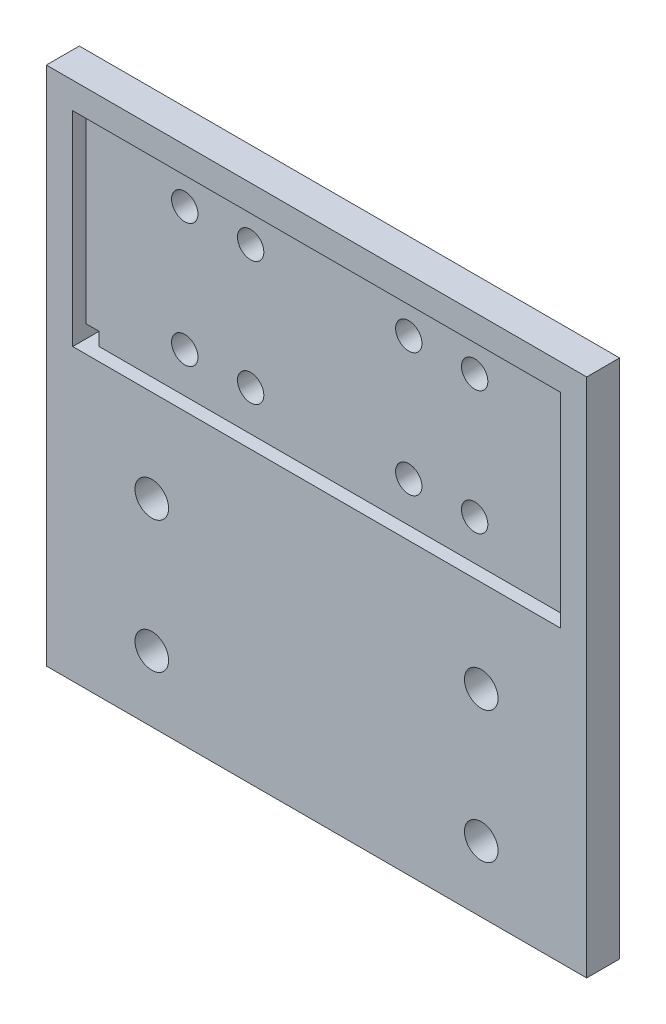
ISO-10303-21;
HEADER;
FILE_DESCRIPTION(('STEP AP214'),'2;1');
FILE_NAME('part.step','',(''),(''),'','','');
FILE_SCHEMA(('AUTOMOTIVE_DESIGN { 1 0 10303 214 1 1 1 1 }'));
ENDSEC;
DATA;
#1=APPLICATION_CONTEXT('core data for automotive mechanical design processes');
#2=APPLICATION_PROTOCOL_DEFINITION('international standard','automotive_design',2000,#1);
#3=PRODUCT_CONTEXT('',#1,'mechanical');
#4=PRODUCT('Part','Part','',(#3));
#5=PRODUCT_RELATED_PRODUCT_CATEGORY('part','',(#4));
#6=PRODUCT_DEFINITION_FORMATION('','',#4);
#7=PRODUCT_DEFINITION_CONTEXT('part definition',#1,'design');
#8=PRODUCT_DEFINITION('design','',#6,#7);
#9=PRODUCT_DEFINITION_SHAPE('','',#8);
#10=(LENGTH_UNIT() NAMED_UNIT(*) SI_UNIT(.MILLI.,.METRE.));
#11=(NAMED_UNIT(*) PLANE_ANGLE_UNIT() SI_UNIT($,.RADIAN.));
#12=(NAMED_UNIT(*) SI_UNIT($,.STERADIAN.) SOLID_ANGLE_UNIT());
#13=UNCERTAINTY_MEASURE_WITH_UNIT(LENGTH_MEASURE(1.E-05),#10,'distance_accuracy_value','');
#14=(GEOMETRIC_REPRESENTATION_CONTEXT(3) GLOBAL_UNCERTAINTY_ASSIGNED_CONTEXT((#13)) GLOBAL_UNIT_ASSIGNED_CONTEXT((#10,
#11,#12)) REPRESENTATION_CONTEXT('',''));
#15=CARTESIAN_POINT('',(0.,0.,0.));
#16=DIRECTION('',(0.,0.,1.));
#17=DIRECTION('',(1.,0.,0.));
#18=AXIS2_PLACEMENT_3D('',#15,#16,#17);
#19=CARTESIAN_POINT('',(0.,0.,5.));
#20=DIRECTION('',(0.,0.,-1.));
#21=DIRECTION('',(-1.,0.,0.));
#22=AXIS2_PLACEMENT_3D('',#19,#20,#21);
#23=PLANE('',#22);
#24=DIRECTION('',(1.,0.,0.));
#25=VECTOR('',#24,1.);
#26=CARTESIAN_POINT('',(-37.,-15.5,5.));
#27=LINE('',#26,#25);
#28=CARTESIAN_POINT('',(-37.,-15.5,5.));
#29=VERTEX_POINT('',#28);
#30=CARTESIAN_POINT('',(37.,-15.5,5.));
#31=VERTEX_POINT('',#30);
#32=EDGE_CURVE('E221',#29,#31,#27,.T.);
#33=ORIENTED_EDGE('',*,*,#32,.F.);
#34=DIRECTION('',(0.,-1.,0.));
#35=VECTOR('',#34,1.);
#36=CARTESIAN_POINT('',(-37.,15.5,5.));
#37=LINE('',#36,#35);
#38=CARTESIAN_POINT('',(-37.,15.5,5.));
#39=VERTEX_POINT('',#38);
#40=EDGE_CURVE('E218',#39,#29,#37,.T.);
#41=ORIENTED_EDGE('',*,*,#40,.F.);
#42=DIRECTION('',(-1.,0.,0.));
#43=VECTOR('',#42,1.);
#44=CARTESIAN_POINT('',(37.,15.5,5.));
#45=LINE('',#44,#43);
#46=CARTESIAN_POINT('',(37.,15.5,5.));
#47=VERTEX_POINT('',#46);
#48=EDGE_CURVE('E229',#47,#39,#45,.T.);
#49=ORIENTED_EDGE('',*,*,#48,.F.);
#50=DIRECTION('',(0.,1.,0.));
#51=VECTOR('',#50,1.);
#52=CARTESIAN_POINT('',(37.,-15.5,5.));
#53=LINE('',#52,#51);
#54=EDGE_CURVE('E226',#31,#47,#53,.T.);
#55=ORIENTED_EDGE('',*,*,#54,.F.);
#56=EDGE_LOOP('',(#33,#41,#49,#55));
#57=FACE_BOUND('',#56,.T.);
#58=DIRECTION('',(0.,1.,0.));
#59=VECTOR('',#58,1.);
#60=CARTESIAN_POINT('',(41.,-19.5,5.));
#61=LINE('',#60,#59);
#62=CARTESIAN_POINT('',(41.,-59.5,5.));
#63=VERTEX_POINT('',#62);
#64=CARTESIAN_POINT('',(41.,19.5,5.));
#65=VERTEX_POINT('',#64);
#66=EDGE_CURVE('E278',#63,#65,#61,.T.);
#67=ORIENTED_EDGE('',*,*,#66,.T.);
#68=DIRECTION('',(-1.,0.,0.));
#69=VECTOR('',#68,1.);
#70=CARTESIAN_POINT('',(-41.,19.5,5.));
#71=LINE('',#70,#69);
#72=CARTESIAN_POINT('',(-41.,19.5,5.));
#73=VERTEX_POINT('',#72);
#74=EDGE_CURVE('E282',#65,#73,#71,.T.);
#75=ORIENTED_EDGE('',*,*,#74,.T.);
#76=DIRECTION('',(0.,-1.,0.));
#77=VECTOR('',#76,1.);
#78=CARTESIAN_POINT('',(-41.,-19.5,5.));
#79=LINE('',#78,#77);
#80=CARTESIAN_POINT('',(-41.,-59.5,5.));
#81=VERTEX_POINT('',#80);
#82=EDGE_CURVE('E286',#73,#81,#79,.T.);
#83=ORIENTED_EDGE('',*,*,#82,.T.);
#84=DIRECTION('',(1.,0.,0.));
#85=VECTOR('',#84,1.);
#86=CARTESIAN_POINT('',(-41.,-59.5,5.));
#87=LINE('',#86,#85);
#88=EDGE_CURVE('E289',#81,#63,#87,.T.);
#89=ORIENTED_EDGE('',*,*,#88,.T.);
#90=EDGE_LOOP('',(#67,#75,#83,#89));
#91=FACE_BOUND('',#90,.T.);
#92=CARTESIAN_POINT('',(-25.,-29.5,5.));
#93=DIRECTION('',(0.,0.,1.));
#94=DIRECTION('',(1.,0.,0.));
#95=AXIS2_PLACEMENT_3D('',#92,#93,#94);
#96=CIRCLE('',#95,2.55);
#97=CARTESIAN_POINT('',(-22.45,-29.5,5.));
#98=VERTEX_POINT('',#97);
#99=EDGE_CURVE('E270',#98,#98,#96,.T.);
#100=ORIENTED_EDGE('',*,*,#99,.F.);
#101=EDGE_LOOP('',(#100));
#102=FACE_BOUND('',#101,.T.);
#103=CARTESIAN_POINT('',(-25.,-49.5,5.));
#104=DIRECTION('',(0.,0.,1.));
#105=DIRECTION('',(1.,0.,0.));
#106=AXIS2_PLACEMENT_3D('',#103,#104,#105);
#107=CIRCLE('',#106,2.55);
#108=CARTESIAN_POINT('',(-22.45,-49.5,5.));
#109=VERTEX_POINT('',#108);
#110=EDGE_CURVE('E262',#109,#109,#107,.T.);
#111=ORIENTED_EDGE('',*,*,#110,.F.);
#112=EDGE_LOOP('',(#111));
#113=FACE_BOUND('',#112,.T.);
#114=CARTESIAN_POINT('',(25.,-49.5,5.));
#115=DIRECTION('',(0.,0.,1.));
#116=DIRECTION('',(-1.,0.,0.));
#117=AXIS2_PLACEMENT_3D('',#114,#115,#116);
#118=CIRCLE('',#117,2.55);
#119=CARTESIAN_POINT('',(22.45,-49.5,5.));
#120=VERTEX_POINT('',#119);
#121=EDGE_CURVE('E254',#120,#120,#118,.T.);
#122=ORIENTED_EDGE('',*,*,#121,.F.);
#123=EDGE_LOOP('',(#122));
#124=FACE_BOUND('',#123,.T.);
#125=CARTESIAN_POINT('',(25.,-29.5,5.));
#126=DIRECTION('',(0.,0.,1.));
#127=DIRECTION('',(-1.,0.,0.));
#128=AXIS2_PLACEMENT_3D('',#125,#126,#127);
#129=CIRCLE('',#128,2.55);
#130=CARTESIAN_POINT('',(22.45,-29.5,5.));
#131=VERTEX_POINT('',#130);
#132=EDGE_CURVE('E246',#131,#131,#129,.T.);
#133=ORIENTED_EDGE('',*,*,#132,.F.);
#134=EDGE_LOOP('',(#133));
#135=FACE_BOUND('',#134,.T.);
#136=ADVANCED_FACE('F39',(#57,#91,#102,#113,#124,#135),#23,.F.);
#137=CARTESIAN_POINT('',(0.,0.,0.));
#138=DIRECTION('',(0.,0.,-1.));
#139=DIRECTION('',(-1.,0.,0.));
#140=AXIS2_PLACEMENT_3D('',#137,#138,#139);
#141=PLANE('',#140);
#142=DIRECTION('',(0.,1.,0.));
#143=VECTOR('',#142,1.);
#144=CARTESIAN_POINT('',(-37.,0.,0.));
#145=LINE('',#144,#143);
#146=CARTESIAN_POINT('',(-37.,13.5,0.));
#147=VERTEX_POINT('',#146);
#148=CARTESIAN_POINT('',(-37.,15.5,0.));
#149=VERTEX_POINT('',#148);
#150=EDGE_CURVE('E11',#147,#149,#145,.T.);
#151=ORIENTED_EDGE('',*,*,#150,.F.);
#152=DIRECTION('',(-1.,0.,0.));
#153=VECTOR('',#152,1.);
#154=CARTESIAN_POINT('',(0.,13.5,0.));
#155=LINE('',#154,#153);
#156=CARTESIAN_POINT('',(-35.,13.5,0.));
#157=VERTEX_POINT('',#156);
#158=EDGE_CURVE('E359',#157,#147,#155,.T.);
#159=ORIENTED_EDGE('',*,*,#158,.F.);
#160=DIRECTION('',(0.,-1.,0.));
#161=VECTOR('',#160,1.);
#162=CARTESIAN_POINT('',(-35.,0.,0.));
#163=LINE('',#162,#161);
#164=CARTESIAN_POINT('',(-35.,15.5,0.));
#165=VERTEX_POINT('',#164);
#166=EDGE_CURVE('E362',#165,#157,#163,.T.);
#167=ORIENTED_EDGE('',*,*,#166,.F.);
#168=DIRECTION('',(1.,0.,0.));
#169=VECTOR('',#168,1.);
#170=CARTESIAN_POINT('',(0.,15.5,0.));
#171=LINE('',#170,#169);
#172=EDGE_CURVE('E48',#149,#165,#171,.T.);
#173=ORIENTED_EDGE('',*,*,#172,.F.);
#174=EDGE_LOOP('',(#151,#159,#167,#173));
#175=FACE_BOUND('',#174,.T.);
#176=CARTESIAN_POINT('',(-22.,-9.39999999999999,0.));
#177=DIRECTION('',(0.,0.,-1.));
#178=DIRECTION('',(-1.,0.,0.));
#179=AXIS2_PLACEMENT_3D('',#176,#177,#178);
#180=CIRCLE('',#179,2.);
#181=CARTESIAN_POINT('',(-24.,-9.39999999999999,0.));
#182=VERTEX_POINT('',#181);
#183=EDGE_CURVE('E222',#182,#182,#180,.T.);
#184=ORIENTED_EDGE('',*,*,#183,.F.);
#185=EDGE_LOOP('',(#184));
#186=FACE_BOUND('',#185,.T.);
#187=CARTESIAN_POINT('',(-12.,-9.39999999999999,0.));
#188=DIRECTION('',(0.,0.,-1.));
#189=DIRECTION('',(-1.,0.,0.));
#190=AXIS2_PLACEMENT_3D('',#187,#188,#189);
#191=CIRCLE('',#190,2.);
#192=CARTESIAN_POINT('',(-14.,-9.39999999999999,0.));
#193=VERTEX_POINT('',#192);
#194=EDGE_CURVE('E445',#193,#193,#191,.T.);
#195=ORIENTED_EDGE('',*,*,#194,.F.);
#196=EDGE_LOOP('',(#195));
#197=FACE_BOUND('',#196,.T.);
#198=CARTESIAN_POINT('',(12.,-9.4,0.));
#199=DIRECTION('',(0.,0.,-1.));
#200=DIRECTION('',(-1.,0.,0.));
#201=AXIS2_PLACEMENT_3D('',#198,#199,#200);
#202=CIRCLE('',#201,2.);
#203=CARTESIAN_POINT('',(10.,-9.4,0.));
#204=VERTEX_POINT('',#203);
#205=EDGE_CURVE('E441',#204,#204,#202,.T.);
#206=ORIENTED_EDGE('',*,*,#205,.F.);
#207=EDGE_LOOP('',(#206));
#208=FACE_BOUND('',#207,.T.);
#209=CARTESIAN_POINT('',(22.,-9.4,0.));
#210=DIRECTION('',(0.,0.,-1.));
#211=DIRECTION('',(-1.,0.,0.));
#212=AXIS2_PLACEMENT_3D('',#209,#210,#211);
#213=CIRCLE('',#212,2.);
#214=CARTESIAN_POINT('',(20.,-9.4,0.));
#215=VERTEX_POINT('',#214);
#216=EDGE_CURVE('E437',#215,#215,#213,.T.);
#217=ORIENTED_EDGE('',*,*,#216,.F.);
#218=EDGE_LOOP('',(#217));
#219=FACE_BOUND('',#218,.T.);
#220=CARTESIAN_POINT('',(22.,9.40000000000001,0.));
#221=DIRECTION('',(0.,0.,-1.));
#222=DIRECTION('',(-1.,0.,0.));
#223=AXIS2_PLACEMENT_3D('',#220,#221,#222);
#224=CIRCLE('',#223,2.);
#225=CARTESIAN_POINT('',(20.,9.40000000000001,0.));
#226=VERTEX_POINT('',#225);
#227=EDGE_CURVE('E433',#226,#226,#224,.T.);
#228=ORIENTED_EDGE('',*,*,#227,.F.);
#229=EDGE_LOOP('',(#228));
#230=FACE_BOUND('',#229,.T.);
#231=CARTESIAN_POINT('',(12.,9.40000000000001,0.));
#232=DIRECTION('',(0.,0.,-1.));
#233=DIRECTION('',(-1.,0.,0.));
#234=AXIS2_PLACEMENT_3D('',#231,#232,#233);
#235=CIRCLE('',#234,2.);
#236=CARTESIAN_POINT('',(10.,9.40000000000001,0.));
#237=VERTEX_POINT('',#236);
#238=EDGE_CURVE('E429',#237,#237,#235,.T.);
#239=ORIENTED_EDGE('',*,*,#238,.F.);
#240=EDGE_LOOP('',(#239));
#241=FACE_BOUND('',#240,.T.);
#242=CARTESIAN_POINT('',(-12.,9.40000000000001,0.));
#243=DIRECTION('',(0.,0.,-1.));
#244=DIRECTION('',(-1.,0.,0.));
#245=AXIS2_PLACEMENT_3D('',#242,#243,#244);
#246=CIRCLE('',#245,2.);
#247=CARTESIAN_POINT('',(-14.,9.40000000000001,0.));
#248=VERTEX_POINT('',#247);
#249=EDGE_CURVE('E425',#248,#248,#246,.T.);
#250=ORIENTED_EDGE('',*,*,#249,.F.);
#251=EDGE_LOOP('',(#250));
#252=FACE_BOUND('',#251,.T.);
#253=DIRECTION('',(0.,-1.,0.));
#254=VECTOR('',#253,1.);
#255=CARTESIAN_POINT('',(37.,0.,0.));
#256=LINE('',#255,#254);
#257=CARTESIAN_POINT('',(37.,-13.5,0.));
#258=VERTEX_POINT('',#257);
#259=CARTESIAN_POINT('',(37.,-15.5,0.));
#260=VERTEX_POINT('',#259);
#261=EDGE_CURVE('E356',#258,#260,#256,.T.);
#262=ORIENTED_EDGE('',*,*,#261,.F.);
#263=DIRECTION('',(1.,0.,0.));
#264=VECTOR('',#263,1.);
#265=CARTESIAN_POINT('',(0.,-13.5,0.));
#266=LINE('',#265,#264);
#267=CARTESIAN_POINT('',(35.,-13.5,0.));
#268=VERTEX_POINT('',#267);
#269=EDGE_CURVE('E180',#268,#258,#266,.T.);
#270=ORIENTED_EDGE('',*,*,#269,.F.);
#271=DIRECTION('',(0.,1.,0.));
#272=VECTOR('',#271,1.);
#273=CARTESIAN_POINT('',(35.,0.,0.));
#274=LINE('',#273,#272);
#275=CARTESIAN_POINT('',(35.,-15.5,0.));
#276=VERTEX_POINT('',#275);
#277=EDGE_CURVE('E350',#276,#268,#274,.T.);
#278=ORIENTED_EDGE('',*,*,#277,.F.);
#279=DIRECTION('',(-1.,0.,0.));
#280=VECTOR('',#279,1.);
#281=CARTESIAN_POINT('',(0.,-15.5,0.));
#282=LINE('',#281,#280);
#283=EDGE_CURVE('E353',#260,#276,#282,.T.);
#284=ORIENTED_EDGE('',*,*,#283,.F.);
#285=EDGE_LOOP('',(#262,#270,#278,#284));
#286=FACE_BOUND('',#285,.T.);
#287=DIRECTION('',(0.,-1.,0.));
#288=VECTOR('',#287,1.);
#289=CARTESIAN_POINT('',(37.,0.,0.));
#290=LINE('',#289,#288);
#291=CARTESIAN_POINT('',(37.,15.5,0.));
#292=VERTEX_POINT('',#291);
#293=CARTESIAN_POINT('',(37.,13.5,0.));
#294=VERTEX_POINT('',#293);
#295=EDGE_CURVE('E345',#292,#294,#290,.T.);
#296=ORIENTED_EDGE('',*,*,#295,.F.);
#297=DIRECTION('',(1.,0.,0.));
#298=VECTOR('',#297,1.);
#299=CARTESIAN_POINT('',(0.,15.5,0.));
#300=LINE('',#299,#298);
#301=CARTESIAN_POINT('',(35.,15.5,0.));
#302=VERTEX_POINT('',#301);
#303=EDGE_CURVE('E334',#302,#292,#300,.T.);
#304=ORIENTED_EDGE('',*,*,#303,.F.);
#305=DIRECTION('',(0.,1.,0.));
#306=VECTOR('',#305,1.);
#307=CARTESIAN_POINT('',(35.,0.,0.));
#308=LINE('',#307,#306);
#309=CARTESIAN_POINT('',(35.,13.5,0.));
#310=VERTEX_POINT('',#309);
#311=EDGE_CURVE('E338',#310,#302,#308,.T.);
#312=ORIENTED_EDGE('',*,*,#311,.F.);
#313=DIRECTION('',(-1.,0.,0.));
#314=VECTOR('',#313,1.);
#315=CARTESIAN_POINT('',(0.,13.5,0.));
#316=LINE('',#315,#314);
#317=EDGE_CURVE('E342',#294,#310,#316,.T.);
#318=ORIENTED_EDGE('',*,*,#317,.F.);
#319=EDGE_LOOP('',(#296,#304,#312,#318));
#320=FACE_BOUND('',#319,.T.);
#321=DIRECTION('',(-1.,0.,0.));
#322=VECTOR('',#321,1.);
#323=CARTESIAN_POINT('',(0.,-15.5,0.));
#324=LINE('',#323,#322);
#325=CARTESIAN_POINT('',(-35.,-15.5,0.));
#326=VERTEX_POINT('',#325);
#327=CARTESIAN_POINT('',(-37.,-15.5,0.));
#328=VERTEX_POINT('',#327);
#329=EDGE_CURVE('E330',#326,#328,#324,.T.);
#330=ORIENTED_EDGE('',*,*,#329,.F.);
#331=DIRECTION('',(0.,-1.,0.));
#332=VECTOR('',#331,1.);
#333=CARTESIAN_POINT('',(-35.,0.,0.));
#334=LINE('',#333,#332);
#335=CARTESIAN_POINT('',(-35.,-13.5,0.));
#336=VERTEX_POINT('',#335);
#337=EDGE_CURVE('E320',#336,#326,#334,.T.);
#338=ORIENTED_EDGE('',*,*,#337,.F.);
#339=DIRECTION('',(1.,0.,0.));
#340=VECTOR('',#339,1.);
#341=CARTESIAN_POINT('',(0.,-13.5,0.));
#342=LINE('',#341,#340);
#343=CARTESIAN_POINT('',(-37.,-13.5,0.));
#344=VERTEX_POINT('',#343);
#345=EDGE_CURVE('E323',#344,#336,#342,.T.);
#346=ORIENTED_EDGE('',*,*,#345,.F.);
#347=DIRECTION('',(0.,1.,0.));
#348=VECTOR('',#347,1.);
#349=CARTESIAN_POINT('',(-37.,0.,0.));
#350=LINE('',#349,#348);
#351=EDGE_CURVE('E327',#328,#344,#350,.T.);
#352=ORIENTED_EDGE('',*,*,#351,.F.);
#353=EDGE_LOOP('',(#330,#338,#346,#352));
#354=FACE_BOUND('',#353,.T.);
#355=CARTESIAN_POINT('',(-22.,9.40000000000001,0.));
#356=DIRECTION('',(0.,0.,-1.));
#357=DIRECTION('',(-1.,0.,0.));
#358=AXIS2_PLACEMENT_3D('',#355,#356,#357);
#359=CIRCLE('',#358,2.);
#360=CARTESIAN_POINT('',(-24.,9.40000000000001,0.));
#361=VERTEX_POINT('',#360);
#362=EDGE_CURVE('E421',#361,#361,#359,.T.);
#363=ORIENTED_EDGE('',*,*,#362,.F.);
#364=EDGE_LOOP('',(#363));
#365=FACE_BOUND('',#364,.T.);
#366=CARTESIAN_POINT('',(25.,-49.5,0.));
#367=DIRECTION('',(0.,0.,1.));
#368=DIRECTION('',(-1.,0.,0.));
#369=AXIS2_PLACEMENT_3D('',#366,#367,#368);
#370=CIRCLE('',#369,2.55);
#371=CARTESIAN_POINT('',(22.45,-49.5,0.));
#372=VERTEX_POINT('',#371);
#373=EDGE_CURVE('E250',#372,#372,#370,.T.);
#374=ORIENTED_EDGE('',*,*,#373,.T.);
#375=EDGE_LOOP('',(#374));
#376=FACE_BOUND('',#375,.T.);
#377=CARTESIAN_POINT('',(-25.,-29.5,0.));
#378=DIRECTION('',(0.,0.,1.));
#379=DIRECTION('',(1.,0.,0.));
#380=AXIS2_PLACEMENT_3D('',#377,#378,#379);
#381=CIRCLE('',#380,2.55);
#382=CARTESIAN_POINT('',(-22.45,-29.5,0.));
#383=VERTEX_POINT('',#382);
#384=EDGE_CURVE('E266',#383,#383,#381,.T.);
#385=ORIENTED_EDGE('',*,*,#384,.T.);
#386=EDGE_LOOP('',(#385));
#387=FACE_BOUND('',#386,.T.);
#388=DIRECTION('',(-1.,0.,0.));
#389=VECTOR('',#388,1.);
#390=CARTESIAN_POINT('',(-41.,19.5,0.));
#391=LINE('',#390,#389);
#392=CARTESIAN_POINT('',(41.,19.5,0.));
#393=VERTEX_POINT('',#392);
#394=CARTESIAN_POINT('',(-41.,19.5,0.));
#395=VERTEX_POINT('',#394);
#396=EDGE_CURVE('E274',#393,#395,#391,.T.);
#397=ORIENTED_EDGE('',*,*,#396,.F.);
#398=DIRECTION('',(0.,1.,0.));
#399=VECTOR('',#398,1.);
#400=CARTESIAN_POINT('',(41.,-59.5,0.));
#401=LINE('',#400,#399);
#402=CARTESIAN_POINT('',(41.,-59.5,0.));
#403=VERTEX_POINT('',#402);
#404=EDGE_CURVE('E283',#403,#393,#401,.T.);
#405=ORIENTED_EDGE('',*,*,#404,.F.);
#406=DIRECTION('',(1.,0.,0.));
#407=VECTOR('',#406,1.);
#408=CARTESIAN_POINT('',(-41.,-59.5,0.));
#409=LINE('',#408,#407);
#410=CARTESIAN_POINT('',(-41.,-59.5,0.));
#411=VERTEX_POINT('',#410);
#412=EDGE_CURVE('E300',#411,#403,#409,.T.);
#413=ORIENTED_EDGE('',*,*,#412,.F.);
#414=DIRECTION('',(0.,-1.,0.));
#415=VECTOR('',#414,1.);
#416=CARTESIAN_POINT('',(-41.,-19.5,0.));
#417=LINE('',#416,#415);
#418=EDGE_CURVE('E297',#395,#411,#417,.T.);
#419=ORIENTED_EDGE('',*,*,#418,.F.);
#420=EDGE_LOOP('',(#397,#405,#413,#419));
#421=FACE_BOUND('',#420,.T.);
#422=CARTESIAN_POINT('',(-25.,-49.5,0.));
#423=DIRECTION('',(0.,0.,1.));
#424=DIRECTION('',(1.,0.,0.));
#425=AXIS2_PLACEMENT_3D('',#422,#423,#424);
#426=CIRCLE('',#425,2.55);
#427=CARTESIAN_POINT('',(-22.45,-49.5,0.));
#428=VERTEX_POINT('',#427);
#429=EDGE_CURVE('E258',#428,#428,#426,.T.);
#430=ORIENTED_EDGE('',*,*,#429,.T.);
#431=EDGE_LOOP('',(#430));
#432=FACE_BOUND('',#431,.T.);
#433=CARTESIAN_POINT('',(25.,-29.5,0.));
#434=DIRECTION('',(0.,0.,1.));
#435=DIRECTION('',(-1.,0.,0.));
#436=AXIS2_PLACEMENT_3D('',#433,#434,#435);
#437=CIRCLE('',#436,2.55);
#438=CARTESIAN_POINT('',(22.45,-29.5,0.));
#439=VERTEX_POINT('',#438);
#440=EDGE_CURVE('E236',#439,#439,#437,.T.);
#441=ORIENTED_EDGE('',*,*,#440,.T.);
#442=EDGE_LOOP('',(#441));
#443=FACE_BOUND('',#442,.T.);
#444=ADVANCED_FACE('F383',(#175,#186,#197,#208,#219,#230,#241,#252,#286,#320,#354,#365,#376,
#387,#421,#432,#443),#141,.T.);
#445=CARTESIAN_POINT('',(-41.,19.5,5.));
#446=DIRECTION('',(0.,-1.,0.));
#447=DIRECTION('',(0.,0.,-1.));
#448=AXIS2_PLACEMENT_3D('',#445,#446,#447);
#449=PLANE('',#448);
#450=ORIENTED_EDGE('',*,*,#396,.T.);
#451=DIRECTION('',(0.,0.,-1.));
#452=VECTOR('',#451,1.);
#453=CARTESIAN_POINT('',(-41.,19.5,5.));
#454=LINE('',#453,#452);
#455=EDGE_CURVE('E312',#73,#395,#454,.T.);
#456=ORIENTED_EDGE('',*,*,#455,.F.);
#457=ORIENTED_EDGE('',*,*,#74,.F.);
#458=DIRECTION('',(0.,0.,-1.));
#459=VECTOR('',#458,1.);
#460=CARTESIAN_POINT('',(41.,19.5,5.));
#461=LINE('',#460,#459);
#462=EDGE_CURVE('E316',#65,#393,#461,.T.);
#463=ORIENTED_EDGE('',*,*,#462,.T.);
#464=EDGE_LOOP('',(#450,#456,#457,#463));
#465=FACE_BOUND('',#464,.T.);
#466=ADVANCED_FACE('F41',(#465),#449,.F.);
#467=CARTESIAN_POINT('',(-41.,-19.5,5.));
#468=DIRECTION('',(1.,0.,0.));
#469=DIRECTION('',(0.,0.,-1.));
#470=AXIS2_PLACEMENT_3D('',#467,#468,#469);
#471=PLANE('',#470);
#472=ORIENTED_EDGE('',*,*,#418,.T.);
#473=DIRECTION('',(0.,0.,-1.));
#474=VECTOR('',#473,1.);
#475=CARTESIAN_POINT('',(-41.,-59.5,5.));
#476=LINE('',#475,#474);
#477=EDGE_CURVE('E308',#81,#411,#476,.T.);
#478=ORIENTED_EDGE('',*,*,#477,.F.);
#479=ORIENTED_EDGE('',*,*,#82,.F.);
#480=ORIENTED_EDGE('',*,*,#455,.T.);
#481=EDGE_LOOP('',(#472,#478,#479,#480));
#482=FACE_BOUND('',#481,.T.);
#483=ADVANCED_FACE('F560',(#482),#471,.F.);
#484=CARTESIAN_POINT('',(-41.,-59.5,5.));
#485=DIRECTION('',(0.,1.,0.));
#486=DIRECTION('',(0.,0.,1.));
#487=AXIS2_PLACEMENT_3D('',#484,#485,#486);
#488=PLANE('',#487);
#489=ORIENTED_EDGE('',*,*,#412,.T.);
#490=DIRECTION('',(0.,0.,-1.));
#491=VECTOR('',#490,1.);
#492=CARTESIAN_POINT('',(41.,-59.5,5.));
#493=LINE('',#492,#491);
#494=EDGE_CURVE('E293',#63,#403,#493,.T.);
#495=ORIENTED_EDGE('',*,*,#494,.F.);
#496=ORIENTED_EDGE('',*,*,#88,.F.);
#497=ORIENTED_EDGE('',*,*,#477,.T.);
#498=EDGE_LOOP('',(#489,#495,#496,#497));
#499=FACE_BOUND('',#498,.T.);
#500=ADVANCED_FACE('F557',(#499),#488,.F.);
#501=CARTESIAN_POINT('',(41.,-59.5,5.));
#502=DIRECTION('',(-1.,0.,0.));
#503=DIRECTION('',(0.,0.,1.));
#504=AXIS2_PLACEMENT_3D('',#501,#502,#503);
#505=PLANE('',#504);
#506=ORIENTED_EDGE('',*,*,#404,.T.);
#507=ORIENTED_EDGE('',*,*,#462,.F.);
#508=ORIENTED_EDGE('',*,*,#66,.F.);
#509=ORIENTED_EDGE('',*,*,#494,.T.);
#510=EDGE_LOOP('',(#506,#507,#508,#509));
#511=FACE_BOUND('',#510,.T.);
#512=ADVANCED_FACE('F554',(#511),#505,.F.);
#513=CARTESIAN_POINT('',(-25.,-29.5,5.));
#514=DIRECTION('',(0.,0.,-1.));
#515=DIRECTION('',(-1.,0.,0.));
#516=AXIS2_PLACEMENT_3D('',#513,#514,#515);
#517=CYLINDRICAL_SURFACE('',#516,2.55);
#518=ORIENTED_EDGE('',*,*,#99,.T.);
#519=EDGE_LOOP('',(#518));
#520=FACE_BOUND('',#519,.T.);
#521=ORIENTED_EDGE('',*,*,#384,.F.);
#522=EDGE_LOOP('',(#521));
#523=FACE_BOUND('',#522,.T.);
#524=ADVANCED_FACE('F551',(#520,#523),#517,.F.);
#525=CARTESIAN_POINT('',(-25.,-49.5,5.));
#526=DIRECTION('',(0.,0.,-1.));
#527=DIRECTION('',(-1.,0.,0.));
#528=AXIS2_PLACEMENT_3D('',#525,#526,#527);
#529=CYLINDRICAL_SURFACE('',#528,2.55);
#530=ORIENTED_EDGE('',*,*,#110,.T.);
#531=EDGE_LOOP('',(#530));
#532=FACE_BOUND('',#531,.T.);
#533=ORIENTED_EDGE('',*,*,#429,.F.);
#534=EDGE_LOOP('',(#533));
#535=FACE_BOUND('',#534,.T.);
#536=ADVANCED_FACE('F600',(#532,#535),#529,.F.);
#537=CARTESIAN_POINT('',(25.,-49.5,5.));
#538=DIRECTION('',(0.,0.,-1.));
#539=DIRECTION('',(-1.,0.,0.));
#540=AXIS2_PLACEMENT_3D('',#537,#538,#539);
#541=CYLINDRICAL_SURFACE('',#540,2.55);
#542=ORIENTED_EDGE('',*,*,#121,.T.);
#543=EDGE_LOOP('',(#542));
#544=FACE_BOUND('',#543,.T.);
#545=ORIENTED_EDGE('',*,*,#373,.F.);
#546=EDGE_LOOP('',(#545));
#547=FACE_BOUND('',#546,.T.);
#548=ADVANCED_FACE('F591',(#544,#547),#541,.F.);
#549=CARTESIAN_POINT('',(25.,-29.5,5.));
#550=DIRECTION('',(0.,0.,-1.));
#551=DIRECTION('',(-1.,0.,0.));
#552=AXIS2_PLACEMENT_3D('',#549,#550,#551);
#553=CYLINDRICAL_SURFACE('',#552,2.55);
#554=ORIENTED_EDGE('',*,*,#132,.T.);
#555=EDGE_LOOP('',(#554));
#556=FACE_BOUND('',#555,.T.);
#557=ORIENTED_EDGE('',*,*,#440,.F.);
#558=EDGE_LOOP('',(#557));
#559=FACE_BOUND('',#558,.T.);
#560=ADVANCED_FACE('F588',(#556,#559),#553,.F.);
#561=CARTESIAN_POINT('',(-37.,15.5,3.));
#562=DIRECTION('',(-1.,0.,0.));
#563=DIRECTION('',(0.,0.,1.));
#564=AXIS2_PLACEMENT_3D('',#561,#562,#563);
#565=PLANE('',#564);
#566=ORIENTED_EDGE('',*,*,#40,.T.);
#567=DIRECTION('',(0.,0.,1.));
#568=VECTOR('',#567,1.);
#569=CARTESIAN_POINT('',(-37.,-15.5,3.));
#570=LINE('',#569,#568);
#571=EDGE_CURVE('E212',#328,#29,#570,.T.);
#572=ORIENTED_EDGE('',*,*,#571,.F.);
#573=ORIENTED_EDGE('',*,*,#351,.T.);
#574=DIRECTION('',(0.,0.,1.));
#575=VECTOR('',#574,1.);
#576=CARTESIAN_POINT('',(-37.,-13.5,-2.));
#577=LINE('',#576,#575);
#578=CARTESIAN_POINT('',(-37.,-13.5,3.));
#579=VERTEX_POINT('',#578);
#580=EDGE_CURVE('E457',#344,#579,#577,.T.);
#581=ORIENTED_EDGE('',*,*,#580,.T.);
#582=DIRECTION('',(0.,-1.,0.));
#583=VECTOR('',#582,1.);
#584=CARTESIAN_POINT('',(-37.,15.5,3.));
#585=LINE('',#584,#583);
#586=CARTESIAN_POINT('',(-37.,13.5,3.));
#587=VERTEX_POINT('',#586);
#588=EDGE_CURVE('E214',#587,#579,#585,.T.);
#589=ORIENTED_EDGE('',*,*,#588,.F.);
#590=DIRECTION('',(0.,0.,1.));
#591=VECTOR('',#590,1.);
#592=CARTESIAN_POINT('',(-37.,13.5,-2.));
#593=LINE('',#592,#591);
#594=EDGE_CURVE('E387',#147,#587,#593,.T.);
#595=ORIENTED_EDGE('',*,*,#594,.F.);
#596=ORIENTED_EDGE('',*,*,#150,.T.);
#597=DIRECTION('',(0.,0.,1.));
#598=VECTOR('',#597,1.);
#599=CARTESIAN_POINT('',(-37.,15.5,3.));
#600=LINE('',#599,#598);
#601=EDGE_CURVE('E233',#149,#39,#600,.T.);
#602=ORIENTED_EDGE('',*,*,#601,.T.);
#603=EDGE_LOOP('',(#566,#572,#573,#581,#589,#595,#596,#602));
#604=FACE_BOUND('',#603,.T.);
#605=ADVANCED_FACE('F390',(#604),#565,.F.);
#606=CARTESIAN_POINT('',(37.,15.5,3.));
#607=DIRECTION('',(0.,1.,0.));
#608=DIRECTION('',(0.,0.,1.));
#609=AXIS2_PLACEMENT_3D('',#606,#607,#608);
#610=PLANE('',#609);
#611=ORIENTED_EDGE('',*,*,#48,.T.);
#612=ORIENTED_EDGE('',*,*,#601,.F.);
#613=ORIENTED_EDGE('',*,*,#172,.T.);
#614=DIRECTION('',(0.,0.,1.));
#615=VECTOR('',#614,1.);
#616=CARTESIAN_POINT('',(-35.,15.5,-2.));
#617=LINE('',#616,#615);
#618=CARTESIAN_POINT('',(-35.,15.5,3.));
#619=VERTEX_POINT('',#618);
#620=EDGE_CURVE('E370',#165,#619,#617,.T.);
#621=ORIENTED_EDGE('',*,*,#620,.T.);
#622=DIRECTION('',(-1.,0.,0.));
#623=VECTOR('',#622,1.);
#624=CARTESIAN_POINT('',(37.,15.5,3.));
#625=LINE('',#624,#623);
#626=CARTESIAN_POINT('',(35.,15.5,3.));
#627=VERTEX_POINT('',#626);
#628=EDGE_CURVE('E206',#627,#619,#625,.T.);
#629=ORIENTED_EDGE('',*,*,#628,.F.);
#630=DIRECTION('',(0.,0.,1.));
#631=VECTOR('',#630,1.);
#632=CARTESIAN_POINT('',(35.,15.5,-2.));
#633=LINE('',#632,#631);
#634=EDGE_CURVE('E473',#302,#627,#633,.T.);
#635=ORIENTED_EDGE('',*,*,#634,.F.);
#636=ORIENTED_EDGE('',*,*,#303,.T.);
#637=DIRECTION('',(0.,0.,1.));
#638=VECTOR('',#637,1.);
#639=CARTESIAN_POINT('',(37.,15.5,3.));
#640=LINE('',#639,#638);
#641=EDGE_CURVE('E237',#292,#47,#640,.T.);
#642=ORIENTED_EDGE('',*,*,#641,.T.);
#643=EDGE_LOOP('',(#611,#612,#613,#621,#629,#635,#636,#642));
#644=FACE_BOUND('',#643,.T.);
#645=ADVANCED_FACE('F368',(#644),#610,.F.);
#646=CARTESIAN_POINT('',(37.,-15.5,3.));
#647=DIRECTION('',(1.,0.,0.));
#648=DIRECTION('',(0.,0.,-1.));
#649=AXIS2_PLACEMENT_3D('',#646,#647,#648);
#650=PLANE('',#649);
#651=ORIENTED_EDGE('',*,*,#54,.T.);
#652=ORIENTED_EDGE('',*,*,#641,.F.);
#653=ORIENTED_EDGE('',*,*,#295,.T.);
#654=DIRECTION('',(0.,0.,1.));
#655=VECTOR('',#654,1.);
#656=CARTESIAN_POINT('',(37.,13.5,-2.));
#657=LINE('',#656,#655);
#658=CARTESIAN_POINT('',(37.,13.5,3.));
#659=VERTEX_POINT('',#658);
#660=EDGE_CURVE('E203',#294,#659,#657,.T.);
#661=ORIENTED_EDGE('',*,*,#660,.T.);
#662=DIRECTION('',(0.,1.,0.));
#663=VECTOR('',#662,1.);
#664=CARTESIAN_POINT('',(37.,-15.5,3.));
#665=LINE('',#664,#663);
#666=CARTESIAN_POINT('',(37.,-13.5,3.));
#667=VERTEX_POINT('',#666);
#668=EDGE_CURVE('E195',#667,#659,#665,.T.);
#669=ORIENTED_EDGE('',*,*,#668,.F.);
#670=DIRECTION('',(0.,0.,1.));
#671=VECTOR('',#670,1.);
#672=CARTESIAN_POINT('',(37.,-13.5,-2.));
#673=LINE('',#672,#671);
#674=EDGE_CURVE('E175',#258,#667,#673,.T.);
#675=ORIENTED_EDGE('',*,*,#674,.F.);
#676=ORIENTED_EDGE('',*,*,#261,.T.);
#677=DIRECTION('',(0.,0.,1.));
#678=VECTOR('',#677,1.);
#679=CARTESIAN_POINT('',(37.,-15.5,3.));
#680=LINE('',#679,#678);
#681=EDGE_CURVE('E240',#260,#31,#680,.T.);
#682=ORIENTED_EDGE('',*,*,#681,.T.);
#683=EDGE_LOOP('',(#651,#652,#653,#661,#669,#675,#676,#682));
#684=FACE_BOUND('',#683,.T.);
#685=ADVANCED_FACE('F201',(#684),#650,.F.);
#686=CARTESIAN_POINT('',(-37.,-15.5,3.));
#687=DIRECTION('',(0.,-1.,0.));
#688=DIRECTION('',(0.,0.,-1.));
#689=AXIS2_PLACEMENT_3D('',#686,#687,#688);
#690=PLANE('',#689);
#691=ORIENTED_EDGE('',*,*,#32,.T.);
#692=ORIENTED_EDGE('',*,*,#681,.F.);
#693=ORIENTED_EDGE('',*,*,#283,.T.);
#694=DIRECTION('',(0.,0.,1.));
#695=VECTOR('',#694,1.);
#696=CARTESIAN_POINT('',(35.,-15.5,-2.));
#697=LINE('',#696,#695);
#698=CARTESIAN_POINT('',(35.,-15.5,3.));
#699=VERTEX_POINT('',#698);
#700=EDGE_CURVE('E489',#276,#699,#697,.T.);
#701=ORIENTED_EDGE('',*,*,#700,.T.);
#702=DIRECTION('',(1.,0.,0.));
#703=VECTOR('',#702,1.);
#704=CARTESIAN_POINT('',(-37.,-15.5,3.));
#705=LINE('',#704,#703);
#706=CARTESIAN_POINT('',(-35.,-15.5,3.));
#707=VERTEX_POINT('',#706);
#708=EDGE_CURVE('E207',#707,#699,#705,.T.);
#709=ORIENTED_EDGE('',*,*,#708,.F.);
#710=DIRECTION('',(0.,0.,1.));
#711=VECTOR('',#710,1.);
#712=CARTESIAN_POINT('',(-35.,-15.5,-2.));
#713=LINE('',#712,#711);
#714=EDGE_CURVE('E490',#326,#707,#713,.T.);
#715=ORIENTED_EDGE('',*,*,#714,.F.);
#716=ORIENTED_EDGE('',*,*,#329,.T.);
#717=ORIENTED_EDGE('',*,*,#571,.T.);
#718=EDGE_LOOP('',(#691,#692,#693,#701,#709,#715,#716,#717));
#719=FACE_BOUND('',#718,.T.);
#720=ADVANCED_FACE('F512',(#719),#690,.F.);
#721=CARTESIAN_POINT('',(0.,0.,3.));
#722=DIRECTION('',(0.,0.,1.));
#723=DIRECTION('',(1.,0.,0.));
#724=AXIS2_PLACEMENT_3D('',#721,#722,#723);
#725=PLANE('',#724);
#726=DIRECTION('',(1.,0.,0.));
#727=VECTOR('',#726,1.);
#728=CARTESIAN_POINT('',(-37.,13.5,3.));
#729=LINE('',#728,#727);
#730=CARTESIAN_POINT('',(-35.,13.5,3.));
#731=VERTEX_POINT('',#730);
#732=EDGE_CURVE('E397',#587,#731,#729,.T.);
#733=ORIENTED_EDGE('',*,*,#732,.F.);
#734=ORIENTED_EDGE('',*,*,#588,.T.);
#735=DIRECTION('',(-1.,0.,0.));
#736=VECTOR('',#735,1.);
#737=CARTESIAN_POINT('',(-37.,-13.5,3.));
#738=LINE('',#737,#736);
#739=CARTESIAN_POINT('',(-35.,-13.5,3.));
#740=VERTEX_POINT('',#739);
#741=EDGE_CURVE('E455',#740,#579,#738,.T.);
#742=ORIENTED_EDGE('',*,*,#741,.F.);
#743=DIRECTION('',(0.,1.,0.));
#744=VECTOR('',#743,1.);
#745=CARTESIAN_POINT('',(-35.,-15.5,3.));
#746=LINE('',#745,#744);
#747=EDGE_CURVE('E483',#707,#740,#746,.T.);
#748=ORIENTED_EDGE('',*,*,#747,.F.);
#749=ORIENTED_EDGE('',*,*,#708,.T.);
#750=DIRECTION('',(0.,-1.,0.));
#751=VECTOR('',#750,1.);
#752=CARTESIAN_POINT('',(35.,-15.5,3.));
#753=LINE('',#752,#751);
#754=CARTESIAN_POINT('',(35.,-13.5,3.));
#755=VERTEX_POINT('',#754);
#756=EDGE_CURVE('E186',#755,#699,#753,.T.);
#757=ORIENTED_EDGE('',*,*,#756,.F.);
#758=DIRECTION('',(-1.,0.,0.));
#759=VECTOR('',#758,1.);
#760=CARTESIAN_POINT('',(37.,-13.5,3.));
#761=LINE('',#760,#759);
#762=EDGE_CURVE('E178',#667,#755,#761,.T.);
#763=ORIENTED_EDGE('',*,*,#762,.F.);
#764=ORIENTED_EDGE('',*,*,#668,.T.);
#765=DIRECTION('',(1.,0.,0.));
#766=VECTOR('',#765,1.);
#767=CARTESIAN_POINT('',(37.,13.5,3.));
#768=LINE('',#767,#766);
#769=CARTESIAN_POINT('',(35.,13.5,3.));
#770=VERTEX_POINT('',#769);
#771=EDGE_CURVE('E477',#770,#659,#768,.T.);
#772=ORIENTED_EDGE('',*,*,#771,.F.);
#773=DIRECTION('',(0.,-1.,0.));
#774=VECTOR('',#773,1.);
#775=CARTESIAN_POINT('',(35.,15.5,3.));
#776=LINE('',#775,#774);
#777=EDGE_CURVE('E486',#627,#770,#776,.T.);
#778=ORIENTED_EDGE('',*,*,#777,.F.);
#779=ORIENTED_EDGE('',*,*,#628,.T.);
#780=DIRECTION('',(0.,1.,0.));
#781=VECTOR('',#780,1.);
#782=CARTESIAN_POINT('',(-35.,15.5,3.));
#783=LINE('',#782,#781);
#784=EDGE_CURVE('E379',#731,#619,#783,.T.);
#785=ORIENTED_EDGE('',*,*,#784,.F.);
#786=EDGE_LOOP('',(#733,#734,#742,#748,#749,#757,#763,#764,#772,#778,#779,#785));
#787=FACE_BOUND('',#786,.T.);
#788=CARTESIAN_POINT('',(-22.,-9.39999999999999,3.));
#789=DIRECTION('',(0.,0.,1.));
#790=DIRECTION('',(-1.,0.,0.));
#791=AXIS2_PLACEMENT_3D('',#788,#789,#790);
#792=CIRCLE('',#791,2.);
#793=CARTESIAN_POINT('',(-24.,-9.39999999999999,3.));
#794=VERTEX_POINT('',#793);
#795=EDGE_CURVE('E381',#794,#794,#792,.T.);
#796=ORIENTED_EDGE('',*,*,#795,.F.);
#797=EDGE_LOOP('',(#796));
#798=FACE_BOUND('',#797,.T.);
#799=CARTESIAN_POINT('',(-12.,-9.39999999999999,3.));
#800=DIRECTION('',(0.,0.,1.));
#801=DIRECTION('',(-1.,0.,0.));
#802=AXIS2_PLACEMENT_3D('',#799,#800,#801);
#803=CIRCLE('',#802,2.);
#804=CARTESIAN_POINT('',(-14.,-9.39999999999999,3.));
#805=VERTEX_POINT('',#804);
#806=EDGE_CURVE('E466',#805,#805,#803,.T.);
#807=ORIENTED_EDGE('',*,*,#806,.F.);
#808=EDGE_LOOP('',(#807));
#809=FACE_BOUND('',#808,.T.);
#810=CARTESIAN_POINT('',(12.,-9.4,3.));
#811=DIRECTION('',(0.,0.,1.));
#812=DIRECTION('',(1.,0.,0.));
#813=AXIS2_PLACEMENT_3D('',#810,#811,#812);
#814=CIRCLE('',#813,2.);
#815=CARTESIAN_POINT('',(14.,-9.4,3.));
#816=VERTEX_POINT('',#815);
#817=EDGE_CURVE('E417',#816,#816,#814,.T.);
#818=ORIENTED_EDGE('',*,*,#817,.F.);
#819=EDGE_LOOP('',(#818));
#820=FACE_BOUND('',#819,.T.);
#821=CARTESIAN_POINT('',(22.,-9.4,3.));
#822=DIRECTION('',(0.,0.,1.));
#823=DIRECTION('',(1.,0.,0.));
#824=AXIS2_PLACEMENT_3D('',#821,#822,#823);
#825=CIRCLE('',#824,2.);
#826=CARTESIAN_POINT('',(24.,-9.4,3.));
#827=VERTEX_POINT('',#826);
#828=EDGE_CURVE('E413',#827,#827,#825,.T.);
#829=ORIENTED_EDGE('',*,*,#828,.F.);
#830=EDGE_LOOP('',(#829));
#831=FACE_BOUND('',#830,.T.);
#832=CARTESIAN_POINT('',(22.,9.40000000000001,3.));
#833=DIRECTION('',(0.,0.,1.));
#834=DIRECTION('',(-1.,0.,0.));
#835=AXIS2_PLACEMENT_3D('',#832,#833,#834);
#836=CIRCLE('',#835,2.);
#837=CARTESIAN_POINT('',(20.,9.40000000000001,3.));
#838=VERTEX_POINT('',#837);
#839=EDGE_CURVE('E409',#838,#838,#836,.T.);
#840=ORIENTED_EDGE('',*,*,#839,.F.);
#841=EDGE_LOOP('',(#840));
#842=FACE_BOUND('',#841,.T.);
#843=CARTESIAN_POINT('',(12.,9.40000000000001,3.));
#844=DIRECTION('',(0.,0.,1.));
#845=DIRECTION('',(-1.,0.,0.));
#846=AXIS2_PLACEMENT_3D('',#843,#844,#845);
#847=CIRCLE('',#846,2.);
#848=CARTESIAN_POINT('',(10.,9.40000000000001,3.));
#849=VERTEX_POINT('',#848);
#850=EDGE_CURVE('E405',#849,#849,#847,.T.);
#851=ORIENTED_EDGE('',*,*,#850,.F.);
#852=EDGE_LOOP('',(#851));
#853=FACE_BOUND('',#852,.T.);
#854=CARTESIAN_POINT('',(-12.,9.40000000000001,3.));
#855=DIRECTION('',(0.,0.,1.));
#856=DIRECTION('',(1.,0.,0.));
#857=AXIS2_PLACEMENT_3D('',#854,#855,#856);
#858=CIRCLE('',#857,2.);
#859=CARTESIAN_POINT('',(-10.,9.40000000000001,3.));
#860=VERTEX_POINT('',#859);
#861=EDGE_CURVE('E400',#860,#860,#858,.T.);
#862=ORIENTED_EDGE('',*,*,#861,.F.);
#863=EDGE_LOOP('',(#862));
#864=FACE_BOUND('',#863,.T.);
#865=CARTESIAN_POINT('',(-22.,9.40000000000001,3.));
#866=DIRECTION('',(0.,0.,1.));
#867=DIRECTION('',(1.,0.,0.));
#868=AXIS2_PLACEMENT_3D('',#865,#866,#867);
#869=CIRCLE('',#868,2.);
#870=CARTESIAN_POINT('',(-20.,9.40000000000001,3.));
#871=VERTEX_POINT('',#870);
#872=EDGE_CURVE('E404',#871,#871,#869,.T.);
#873=ORIENTED_EDGE('',*,*,#872,.F.);
#874=EDGE_LOOP('',(#873));
#875=FACE_BOUND('',#874,.T.);
#876=ADVANCED_FACE('F192',(#787,#798,#809,#820,#831,#842,#853,#864,#875),#725,.T.);
#877=CARTESIAN_POINT('',(-22.,9.40000000000001,-2.));
#878=DIRECTION('',(0.,0.,1.));
#879=DIRECTION('',(1.,0.,0.));
#880=AXIS2_PLACEMENT_3D('',#877,#878,#879);
#881=CYLINDRICAL_SURFACE('',#880,2.);
#882=ORIENTED_EDGE('',*,*,#362,.T.);
#883=EDGE_LOOP('',(#882));
#884=FACE_BOUND('',#883,.T.);
#885=ORIENTED_EDGE('',*,*,#872,.T.);
#886=EDGE_LOOP('',(#885));
#887=FACE_BOUND('',#886,.T.);
#888=ADVANCED_FACE('F690',(#884,#887),#881,.F.);
#889=CARTESIAN_POINT('',(-12.,9.40000000000001,-2.));
#890=DIRECTION('',(0.,0.,1.));
#891=DIRECTION('',(1.,0.,0.));
#892=AXIS2_PLACEMENT_3D('',#889,#890,#891);
#893=CYLINDRICAL_SURFACE('',#892,2.);
#894=ORIENTED_EDGE('',*,*,#249,.T.);
#895=EDGE_LOOP('',(#894));
#896=FACE_BOUND('',#895,.T.);
#897=ORIENTED_EDGE('',*,*,#861,.T.);
#898=EDGE_LOOP('',(#897));
#899=FACE_BOUND('',#898,.T.);
#900=ADVANCED_FACE('F699',(#896,#899),#893,.F.);
#901=CARTESIAN_POINT('',(12.,9.40000000000001,-2.));
#902=DIRECTION('',(0.,0.,1.));
#903=DIRECTION('',(1.,0.,0.));
#904=AXIS2_PLACEMENT_3D('',#901,#902,#903);
#905=CYLINDRICAL_SURFACE('',#904,2.);
#906=ORIENTED_EDGE('',*,*,#238,.T.);
#907=EDGE_LOOP('',(#906));
#908=FACE_BOUND('',#907,.T.);
#909=ORIENTED_EDGE('',*,*,#850,.T.);
#910=EDGE_LOOP('',(#909));
#911=FACE_BOUND('',#910,.T.);
#912=ADVANCED_FACE('F709',(#908,#911),#905,.F.);
#913=CARTESIAN_POINT('',(22.,9.40000000000001,-2.));
#914=DIRECTION('',(0.,0.,1.));
#915=DIRECTION('',(1.,0.,0.));
#916=AXIS2_PLACEMENT_3D('',#913,#914,#915);
#917=CYLINDRICAL_SURFACE('',#916,2.);
#918=ORIENTED_EDGE('',*,*,#227,.T.);
#919=EDGE_LOOP('',(#918));
#920=FACE_BOUND('',#919,.T.);
#921=ORIENTED_EDGE('',*,*,#839,.T.);
#922=EDGE_LOOP('',(#921));
#923=FACE_BOUND('',#922,.T.);
#924=ADVANCED_FACE('F719',(#920,#923),#917,.F.);
#925=CARTESIAN_POINT('',(22.,-9.4,-2.));
#926=DIRECTION('',(0.,0.,1.));
#927=DIRECTION('',(1.,0.,0.));
#928=AXIS2_PLACEMENT_3D('',#925,#926,#927);
#929=CYLINDRICAL_SURFACE('',#928,2.);
#930=ORIENTED_EDGE('',*,*,#216,.T.);
#931=EDGE_LOOP('',(#930));
#932=FACE_BOUND('',#931,.T.);
#933=ORIENTED_EDGE('',*,*,#828,.T.);
#934=EDGE_LOOP('',(#933));
#935=FACE_BOUND('',#934,.T.);
#936=ADVANCED_FACE('F729',(#932,#935),#929,.F.);
#937=CARTESIAN_POINT('',(12.,-9.4,-2.));
#938=DIRECTION('',(0.,0.,1.));
#939=DIRECTION('',(1.,0.,0.));
#940=AXIS2_PLACEMENT_3D('',#937,#938,#939);
#941=CYLINDRICAL_SURFACE('',#940,2.);
#942=ORIENTED_EDGE('',*,*,#205,.T.);
#943=EDGE_LOOP('',(#942));
#944=FACE_BOUND('',#943,.T.);
#945=ORIENTED_EDGE('',*,*,#817,.T.);
#946=EDGE_LOOP('',(#945));
#947=FACE_BOUND('',#946,.T.);
#948=ADVANCED_FACE('F739',(#944,#947),#941,.F.);
#949=CARTESIAN_POINT('',(-12.,-9.39999999999999,-2.));
#950=DIRECTION('',(0.,0.,1.));
#951=DIRECTION('',(1.,0.,0.));
#952=AXIS2_PLACEMENT_3D('',#949,#950,#951);
#953=CYLINDRICAL_SURFACE('',#952,2.);
#954=ORIENTED_EDGE('',*,*,#194,.T.);
#955=EDGE_LOOP('',(#954));
#956=FACE_BOUND('',#955,.T.);
#957=ORIENTED_EDGE('',*,*,#806,.T.);
#958=EDGE_LOOP('',(#957));
#959=FACE_BOUND('',#958,.T.);
#960=ADVANCED_FACE('F749',(#956,#959),#953,.F.);
#961=CARTESIAN_POINT('',(-22.,-9.39999999999999,-2.));
#962=DIRECTION('',(0.,0.,1.));
#963=DIRECTION('',(1.,0.,0.));
#964=AXIS2_PLACEMENT_3D('',#961,#962,#963);
#965=CYLINDRICAL_SURFACE('',#964,2.);
#966=ORIENTED_EDGE('',*,*,#183,.T.);
#967=EDGE_LOOP('',(#966));
#968=FACE_BOUND('',#967,.T.);
#969=ORIENTED_EDGE('',*,*,#795,.T.);
#970=EDGE_LOOP('',(#969));
#971=FACE_BOUND('',#970,.T.);
#972=ADVANCED_FACE('F758',(#968,#971),#965,.F.);
#973=CARTESIAN_POINT('',(-37.,-13.5,-2.));
#974=DIRECTION('',(0.,1.,0.));
#975=DIRECTION('',(0.,0.,1.));
#976=AXIS2_PLACEMENT_3D('',#973,#974,#975);
#977=PLANE('',#976);
#978=ORIENTED_EDGE('',*,*,#345,.T.);
#979=DIRECTION('',(0.,0.,1.));
#980=VECTOR('',#979,1.);
#981=CARTESIAN_POINT('',(-35.,-13.5,-2.));
#982=LINE('',#981,#980);
#983=EDGE_CURVE('E460',#336,#740,#982,.T.);
#984=ORIENTED_EDGE('',*,*,#983,.T.);
#985=ORIENTED_EDGE('',*,*,#741,.T.);
#986=ORIENTED_EDGE('',*,*,#580,.F.);
#987=EDGE_LOOP('',(#978,#984,#985,#986));
#988=FACE_BOUND('',#987,.T.);
#989=ADVANCED_FACE('F768',(#988),#977,.F.);
#990=CARTESIAN_POINT('',(-35.,-15.5,-2.));
#991=DIRECTION('',(1.,0.,0.));
#992=DIRECTION('',(0.,0.,-1.));
#993=AXIS2_PLACEMENT_3D('',#990,#991,#992);
#994=PLANE('',#993);
#995=ORIENTED_EDGE('',*,*,#337,.T.);
#996=ORIENTED_EDGE('',*,*,#714,.T.);
#997=ORIENTED_EDGE('',*,*,#747,.T.);
#998=ORIENTED_EDGE('',*,*,#983,.F.);
#999=EDGE_LOOP('',(#995,#996,#997,#998));
#1000=FACE_BOUND('',#999,.T.);
#1001=ADVANCED_FACE('F541',(#1000),#994,.F.);
#1002=CARTESIAN_POINT('',(37.,13.5,-2.));
#1003=DIRECTION('',(0.,-1.,0.));
#1004=DIRECTION('',(0.,0.,-1.));
#1005=AXIS2_PLACEMENT_3D('',#1002,#1003,#1004);
#1006=PLANE('',#1005);
#1007=ORIENTED_EDGE('',*,*,#317,.T.);
#1008=DIRECTION('',(0.,0.,1.));
#1009=VECTOR('',#1008,1.);
#1010=CARTESIAN_POINT('',(35.,13.5,-2.));
#1011=LINE('',#1010,#1009);
#1012=EDGE_CURVE('E476',#310,#770,#1011,.T.);
#1013=ORIENTED_EDGE('',*,*,#1012,.T.);
#1014=ORIENTED_EDGE('',*,*,#771,.T.);
#1015=ORIENTED_EDGE('',*,*,#660,.F.);
#1016=EDGE_LOOP('',(#1007,#1013,#1014,#1015));
#1017=FACE_BOUND('',#1016,.T.);
#1018=ADVANCED_FACE('F527',(#1017),#1006,.F.);
#1019=CARTESIAN_POINT('',(35.,15.5,-2.));
#1020=DIRECTION('',(-1.,0.,0.));
#1021=DIRECTION('',(0.,0.,1.));
#1022=AXIS2_PLACEMENT_3D('',#1019,#1020,#1021);
#1023=PLANE('',#1022);
#1024=ORIENTED_EDGE('',*,*,#311,.T.);
#1025=ORIENTED_EDGE('',*,*,#634,.T.);
#1026=ORIENTED_EDGE('',*,*,#777,.T.);
#1027=ORIENTED_EDGE('',*,*,#1012,.F.);
#1028=EDGE_LOOP('',(#1024,#1025,#1026,#1027));
#1029=FACE_BOUND('',#1028,.T.);
#1030=ADVANCED_FACE('F532',(#1029),#1023,.F.);
#1031=CARTESIAN_POINT('',(35.,-15.5,-2.));
#1032=DIRECTION('',(-1.,0.,0.));
#1033=DIRECTION('',(0.,0.,1.));
#1034=AXIS2_PLACEMENT_3D('',#1031,#1032,#1033);
#1035=PLANE('',#1034);
#1036=ORIENTED_EDGE('',*,*,#277,.T.);
#1037=DIRECTION('',(0.,0.,1.));
#1038=VECTOR('',#1037,1.);
#1039=CARTESIAN_POINT('',(35.,-13.5,-2.));
#1040=LINE('',#1039,#1038);
#1041=EDGE_CURVE('E63',#268,#755,#1040,.T.);
#1042=ORIENTED_EDGE('',*,*,#1041,.T.);
#1043=ORIENTED_EDGE('',*,*,#756,.T.);
#1044=ORIENTED_EDGE('',*,*,#700,.F.);
#1045=EDGE_LOOP('',(#1036,#1042,#1043,#1044));
#1046=FACE_BOUND('',#1045,.T.);
#1047=ADVANCED_FACE('F507',(#1046),#1035,.F.);
#1048=CARTESIAN_POINT('',(37.,-13.5,-2.));
#1049=DIRECTION('',(0.,1.,0.));
#1050=DIRECTION('',(0.,0.,1.));
#1051=AXIS2_PLACEMENT_3D('',#1048,#1049,#1050);
#1052=PLANE('',#1051);
#1053=ORIENTED_EDGE('',*,*,#269,.T.);
#1054=ORIENTED_EDGE('',*,*,#674,.T.);
#1055=ORIENTED_EDGE('',*,*,#762,.T.);
#1056=ORIENTED_EDGE('',*,*,#1041,.F.);
#1057=EDGE_LOOP('',(#1053,#1054,#1055,#1056));
#1058=FACE_BOUND('',#1057,.T.);
#1059=ADVANCED_FACE('F177',(#1058),#1052,.F.);
#1060=CARTESIAN_POINT('',(-35.,15.5,-2.));
#1061=DIRECTION('',(1.,0.,0.));
#1062=DIRECTION('',(0.,0.,-1.));
#1063=AXIS2_PLACEMENT_3D('',#1060,#1061,#1062);
#1064=PLANE('',#1063);
#1065=ORIENTED_EDGE('',*,*,#166,.T.);
#1066=DIRECTION('',(0.,0.,1.));
#1067=VECTOR('',#1066,1.);
#1068=CARTESIAN_POINT('',(-35.,13.5,-2.));
#1069=LINE('',#1068,#1067);
#1070=EDGE_CURVE('E55',#157,#731,#1069,.T.);
#1071=ORIENTED_EDGE('',*,*,#1070,.T.);
#1072=ORIENTED_EDGE('',*,*,#784,.T.);
#1073=ORIENTED_EDGE('',*,*,#620,.F.);
#1074=EDGE_LOOP('',(#1065,#1071,#1072,#1073));
#1075=FACE_BOUND('',#1074,.T.);
#1076=ADVANCED_FACE('F376',(#1075),#1064,.F.);
#1077=CARTESIAN_POINT('',(-37.,13.5,-2.));
#1078=DIRECTION('',(0.,-1.,0.));
#1079=DIRECTION('',(0.,0.,-1.));
#1080=AXIS2_PLACEMENT_3D('',#1077,#1078,#1079);
#1081=PLANE('',#1080);
#1082=ORIENTED_EDGE('',*,*,#158,.T.);
#1083=ORIENTED_EDGE('',*,*,#594,.T.);
#1084=ORIENTED_EDGE('',*,*,#732,.T.);
#1085=ORIENTED_EDGE('',*,*,#1070,.F.);
#1086=EDGE_LOOP('',(#1082,#1083,#1084,#1085));
#1087=FACE_BOUND('',#1086,.T.);
#1088=ADVANCED_FACE('F386',(#1087),#1081,.F.);
#1089=CLOSED_SHELL('',(#136,#444,#466,#483,#500,#512,#524,#536,#548,#560,#605,#645,#685,#720,
#876,#888,#900,#912,#924,#936,#948,#960,#972,#989,#1001,#1018,#1030,#1047,#1059,#1076,#1088));
#1090=MANIFOLD_SOLID_BREP('B2',#1089);
#1091=ADVANCED_BREP_SHAPE_REPRESENTATION('',(#18,#1090),#14);
#1092=SHAPE_DEFINITION_REPRESENTATION(#9,#1091);
ENDSEC;
END-ISO-10303-21;
